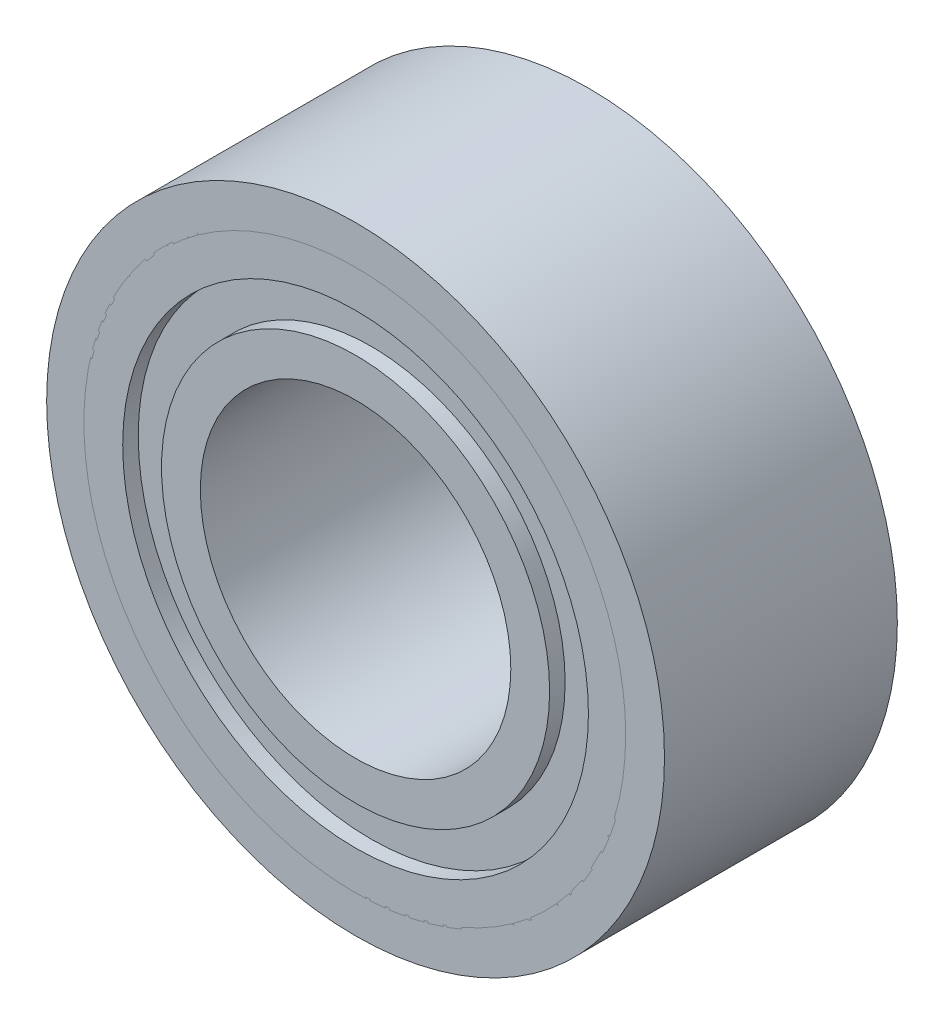
ISO-10303-21;
HEADER;
FILE_DESCRIPTION(('STEP AP214'),'2;1');
FILE_NAME('part.step','',(''),(''),'','','');
FILE_SCHEMA(('AUTOMOTIVE_DESIGN { 1 0 10303 214 1 1 1 1 }'));
ENDSEC;
DATA;
#1=APPLICATION_CONTEXT('core data for automotive mechanical design processes');
#2=APPLICATION_PROTOCOL_DEFINITION('international standard','automotive_design',2000,#1);
#3=PRODUCT_CONTEXT('',#1,'mechanical');
#4=PRODUCT('Part','Part','',(#3));
#5=PRODUCT_RELATED_PRODUCT_CATEGORY('part','',(#4));
#6=PRODUCT_DEFINITION_FORMATION('','',#4);
#7=PRODUCT_DEFINITION_CONTEXT('part definition',#1,'design');
#8=PRODUCT_DEFINITION('design','',#6,#7);
#9=PRODUCT_DEFINITION_SHAPE('','',#8);
#10=(LENGTH_UNIT() NAMED_UNIT(*) SI_UNIT(.MILLI.,.METRE.));
#11=(NAMED_UNIT(*) PLANE_ANGLE_UNIT() SI_UNIT($,.RADIAN.));
#12=(NAMED_UNIT(*) SI_UNIT($,.STERADIAN.) SOLID_ANGLE_UNIT());
#13=UNCERTAINTY_MEASURE_WITH_UNIT(LENGTH_MEASURE(1.E-05),#10,'distance_accuracy_value','');
#14=(GEOMETRIC_REPRESENTATION_CONTEXT(3) GLOBAL_UNCERTAINTY_ASSIGNED_CONTEXT((#13)) GLOBAL_UNIT_ASSIGNED_CONTEXT((#10,
#11,#12)) REPRESENTATION_CONTEXT('',''));
#15=CARTESIAN_POINT('',(0.,0.,0.));
#16=DIRECTION('',(0.,0.,1.));
#17=DIRECTION('',(1.,0.,0.));
#18=AXIS2_PLACEMENT_3D('',#15,#16,#17);
#19=CARTESIAN_POINT('',(0.,0.,0.2));
#20=DIRECTION('',(0.,0.,1.));
#21=DIRECTION('',(1.,0.,0.));
#22=AXIS2_PLACEMENT_3D('',#19,#20,#21);
#23=CYLINDRICAL_SURFACE('',#22,2.5);
#24=CARTESIAN_POINT('',(0.,0.,0.2));
#25=DIRECTION('',(0.,0.,1.));
#26=DIRECTION('',(1.,0.,0.));
#27=AXIS2_PLACEMENT_3D('',#24,#25,#26);
#28=CIRCLE('',#27,2.5);
#29=CARTESIAN_POINT('',(2.5,0.,0.2));
#30=VERTEX_POINT('',#29);
#31=EDGE_CURVE('E63',#30,#30,#28,.T.);
#32=ORIENTED_EDGE('',*,*,#31,.F.);
#33=EDGE_LOOP('',(#32));
#34=FACE_BOUND('',#33,.T.);
#35=CARTESIAN_POINT('',(0.,0.,2.8));
#36=DIRECTION('',(0.,0.,1.));
#37=DIRECTION('',(1.,0.,0.));
#38=AXIS2_PLACEMENT_3D('',#35,#36,#37);
#39=CIRCLE('',#38,2.5);
#40=CARTESIAN_POINT('',(2.5,0.,2.8));
#41=VERTEX_POINT('',#40);
#42=EDGE_CURVE('E51',#41,#41,#39,.F.);
#43=ORIENTED_EDGE('',*,*,#42,.F.);
#44=EDGE_LOOP('',(#43));
#45=FACE_BOUND('',#44,.T.);
#46=ADVANCED_FACE('F47',(#34,#45),#23,.F.);
#47=CARTESIAN_POINT('',(0.,0.,0.2));
#48=DIRECTION('',(0.,0.,1.));
#49=DIRECTION('',(1.,0.,0.));
#50=AXIS2_PLACEMENT_3D('',#47,#48,#49);
#51=CYLINDRICAL_SURFACE('',#50,3.5);
#52=CARTESIAN_POINT('',(0.,0.,0.2));
#53=DIRECTION('',(0.,0.,1.));
#54=DIRECTION('',(1.,0.,0.));
#55=AXIS2_PLACEMENT_3D('',#52,#53,#54);
#56=CIRCLE('',#55,3.5);
#57=CARTESIAN_POINT('',(3.5,0.,0.2));
#58=VERTEX_POINT('',#57);
#59=EDGE_CURVE('E11',#58,#58,#56,.T.);
#60=ORIENTED_EDGE('',*,*,#59,.T.);
#61=EDGE_LOOP('',(#60));
#62=FACE_BOUND('',#61,.T.);
#63=CARTESIAN_POINT('',(0.,0.,3.));
#64=DIRECTION('',(0.,0.,1.));
#65=DIRECTION('',(1.,0.,0.));
#66=AXIS2_PLACEMENT_3D('',#63,#64,#65);
#67=CIRCLE('',#66,3.5);
#68=CARTESIAN_POINT('',(3.5,0.,3.));
#69=VERTEX_POINT('',#68);
#70=EDGE_CURVE('E56',#69,#69,#67,.T.);
#71=ORIENTED_EDGE('',*,*,#70,.F.);
#72=EDGE_LOOP('',(#71));
#73=FACE_BOUND('',#72,.T.);
#74=ADVANCED_FACE('F49',(#62,#73),#51,.T.);
#75=CARTESIAN_POINT('',(0.,0.,0.2));
#76=DIRECTION('',(0.,0.,1.));
#77=DIRECTION('',(1.,0.,0.));
#78=AXIS2_PLACEMENT_3D('',#75,#76,#77);
#79=PLANE('',#78);
#80=ORIENTED_EDGE('',*,*,#31,.T.);
#81=EDGE_LOOP('',(#80));
#82=FACE_BOUND('',#81,.T.);
#83=ORIENTED_EDGE('',*,*,#59,.F.);
#84=EDGE_LOOP('',(#83));
#85=FACE_BOUND('',#84,.T.);
#86=ADVANCED_FACE('F91',(#82,#85),#79,.F.);
#87=CARTESIAN_POINT('',(0.,0.,3.));
#88=DIRECTION('',(0.,0.,1.));
#89=DIRECTION('',(1.,0.,0.));
#90=AXIS2_PLACEMENT_3D('',#87,#88,#89);
#91=PLANE('',#90);
#92=CARTESIAN_POINT('',(0.,0.,3.));
#93=DIRECTION('',(0.,0.,1.));
#94=DIRECTION('',(1.,0.,0.));
#95=AXIS2_PLACEMENT_3D('',#92,#93,#94);
#96=CIRCLE('',#95,3.);
#97=CARTESIAN_POINT('',(3.,0.,3.));
#98=VERTEX_POINT('',#97);
#99=EDGE_CURVE('E68',#98,#98,#96,.T.);
#100=ORIENTED_EDGE('',*,*,#99,.F.);
#101=EDGE_LOOP('',(#100));
#102=FACE_BOUND('',#101,.T.);
#103=ORIENTED_EDGE('',*,*,#70,.T.);
#104=EDGE_LOOP('',(#103));
#105=FACE_BOUND('',#104,.T.);
#106=ADVANCED_FACE('F98',(#102,#105),#91,.T.);
#107=CARTESIAN_POINT('',(0.,0.,2.8));
#108=DIRECTION('',(0.,0.,1.));
#109=DIRECTION('',(1.,0.,0.));
#110=AXIS2_PLACEMENT_3D('',#107,#108,#109);
#111=PLANE('',#110);
#112=CARTESIAN_POINT('',(0.,0.,2.8));
#113=DIRECTION('',(0.,0.,1.));
#114=DIRECTION('',(1.,0.,0.));
#115=AXIS2_PLACEMENT_3D('',#112,#113,#114);
#116=CIRCLE('',#115,3.);
#117=CARTESIAN_POINT('',(3.,0.,2.8));
#118=VERTEX_POINT('',#117);
#119=EDGE_CURVE('E72',#118,#118,#116,.T.);
#120=ORIENTED_EDGE('',*,*,#119,.T.);
#121=EDGE_LOOP('',(#120));
#122=FACE_BOUND('',#121,.T.);
#123=ORIENTED_EDGE('',*,*,#42,.T.);
#124=EDGE_LOOP('',(#123));
#125=FACE_BOUND('',#124,.T.);
#126=ADVANCED_FACE('F83',(#122,#125),#111,.T.);
#127=CARTESIAN_POINT('',(0.,0.,2.8));
#128=DIRECTION('',(0.,0.,1.));
#129=DIRECTION('',(1.,0.,0.));
#130=AXIS2_PLACEMENT_3D('',#127,#128,#129);
#131=CYLINDRICAL_SURFACE('',#130,3.);
#132=ORIENTED_EDGE('',*,*,#119,.F.);
#133=EDGE_LOOP('',(#132));
#134=FACE_BOUND('',#133,.T.);
#135=ORIENTED_EDGE('',*,*,#99,.T.);
#136=EDGE_LOOP('',(#135));
#137=FACE_BOUND('',#136,.T.);
#138=ADVANCED_FACE('F95',(#134,#137),#131,.F.);
#139=CLOSED_SHELL('',(#46,#74,#86,#106,#126,#138));
#140=MANIFOLD_SOLID_BREP('B2',#139);
#141=CARTESIAN_POINT('',(0.,0.,3.));
#142=DIRECTION('',(0.,0.,1.));
#143=DIRECTION('',(1.,0.,0.));
#144=AXIS2_PLACEMENT_3D('',#141,#142,#143);
#145=PLANE('',#144);
#146=CARTESIAN_POINT('',(0.,0.,3.));
#147=DIRECTION('',(0.,0.,1.));
#148=DIRECTION('',(1.,0.,0.));
#149=AXIS2_PLACEMENT_3D('',#146,#147,#148);
#150=CIRCLE('',#149,3.48);
#151=CARTESIAN_POINT('',(3.48,0.,3.));
#152=VERTEX_POINT('',#151);
#153=EDGE_CURVE('E46',#152,#152,#150,.T.);
#154=ORIENTED_EDGE('',*,*,#153,.F.);
#155=EDGE_LOOP('',(#154));
#156=FACE_BOUND('',#155,.T.);
#157=CARTESIAN_POINT('',(0.,0.,3.));
#158=DIRECTION('',(0.,0.,1.));
#159=DIRECTION('',(1.,0.,0.));
#160=AXIS2_PLACEMENT_3D('',#157,#158,#159);
#161=CIRCLE('',#160,3.98);
#162=CARTESIAN_POINT('',(3.98,0.,3.));
#163=VERTEX_POINT('',#162);
#164=EDGE_CURVE('E186',#163,#163,#161,.T.);
#165=ORIENTED_EDGE('',*,*,#164,.T.);
#166=EDGE_LOOP('',(#165));
#167=FACE_BOUND('',#166,.T.);
#168=ADVANCED_FACE('F169',(#156,#167),#145,.T.);
#169=CARTESIAN_POINT('',(0.,0.,0.));
#170=DIRECTION('',(0.,0.,1.));
#171=DIRECTION('',(1.,0.,0.));
#172=AXIS2_PLACEMENT_3D('',#169,#170,#171);
#173=PLANE('',#172);
#174=CARTESIAN_POINT('',(0.,0.,0.));
#175=DIRECTION('',(0.,0.,1.));
#176=DIRECTION('',(1.,0.,0.));
#177=AXIS2_PLACEMENT_3D('',#174,#175,#176);
#178=CIRCLE('',#177,3.48);
#179=CARTESIAN_POINT('',(3.48,0.,0.));
#180=VERTEX_POINT('',#179);
#181=EDGE_CURVE('E173',#180,#180,#178,.T.);
#182=ORIENTED_EDGE('',*,*,#181,.T.);
#183=EDGE_LOOP('',(#182));
#184=FACE_BOUND('',#183,.T.);
#185=CARTESIAN_POINT('',(0.,0.,0.));
#186=DIRECTION('',(0.,0.,1.));
#187=DIRECTION('',(1.,0.,0.));
#188=AXIS2_PLACEMENT_3D('',#185,#186,#187);
#189=CIRCLE('',#188,3.98);
#190=CARTESIAN_POINT('',(3.98,0.,0.));
#191=VERTEX_POINT('',#190);
#192=EDGE_CURVE('E178',#191,#191,#189,.T.);
#193=ORIENTED_EDGE('',*,*,#192,.F.);
#194=EDGE_LOOP('',(#193));
#195=FACE_BOUND('',#194,.T.);
#196=ADVANCED_FACE('F171',(#184,#195),#173,.F.);
#197=CARTESIAN_POINT('',(0.,0.,3.));
#198=DIRECTION('',(0.,0.,-1.));
#199=DIRECTION('',(-1.,0.,0.));
#200=AXIS2_PLACEMENT_3D('',#197,#198,#199);
#201=CYLINDRICAL_SURFACE('',#200,3.98);
#202=ORIENTED_EDGE('',*,*,#164,.F.);
#203=EDGE_LOOP('',(#202));
#204=FACE_BOUND('',#203,.T.);
#205=ORIENTED_EDGE('',*,*,#192,.T.);
#206=EDGE_LOOP('',(#205));
#207=FACE_BOUND('',#206,.T.);
#208=ADVANCED_FACE('F201',(#204,#207),#201,.T.);
#209=CARTESIAN_POINT('',(0.,0.,0.));
#210=DIRECTION('',(0.,0.,1.));
#211=DIRECTION('',(1.,0.,0.));
#212=AXIS2_PLACEMENT_3D('',#209,#210,#211);
#213=CYLINDRICAL_SURFACE('',#212,3.48);
#214=ORIENTED_EDGE('',*,*,#181,.F.);
#215=EDGE_LOOP('',(#214));
#216=FACE_BOUND('',#215,.T.);
#217=ORIENTED_EDGE('',*,*,#153,.T.);
#218=EDGE_LOOP('',(#217));
#219=FACE_BOUND('',#218,.T.);
#220=ADVANCED_FACE('F199',(#216,#219),#213,.F.);
#221=CLOSED_SHELL('',(#168,#196,#208,#220));
#222=MANIFOLD_SOLID_BREP('B6',#221);
#223=CARTESIAN_POINT('',(0.,0.,3.));
#224=DIRECTION('',(0.,0.,1.));
#225=DIRECTION('',(1.,0.,0.));
#226=AXIS2_PLACEMENT_3D('',#223,#224,#225);
#227=PLANE('',#226);
#228=CARTESIAN_POINT('',(0.,0.,3.));
#229=DIRECTION('',(0.,0.,1.));
#230=DIRECTION('',(1.,0.,0.));
#231=AXIS2_PLACEMENT_3D('',#228,#229,#230);
#232=CIRCLE('',#231,2.);
#233=CARTESIAN_POINT('',(2.,0.,3.));
#234=VERTEX_POINT('',#233);
#235=EDGE_CURVE('E168',#234,#234,#232,.T.);
#236=ORIENTED_EDGE('',*,*,#235,.F.);
#237=EDGE_LOOP('',(#236));
#238=FACE_BOUND('',#237,.T.);
#239=CARTESIAN_POINT('',(0.,0.,3.));
#240=DIRECTION('',(0.,0.,1.));
#241=DIRECTION('',(1.,0.,0.));
#242=AXIS2_PLACEMENT_3D('',#239,#240,#241);
#243=CIRCLE('',#242,2.5);
#244=CARTESIAN_POINT('',(2.5,0.,3.));
#245=VERTEX_POINT('',#244);
#246=EDGE_CURVE('E262',#245,#245,#243,.T.);
#247=ORIENTED_EDGE('',*,*,#246,.T.);
#248=EDGE_LOOP('',(#247));
#249=FACE_BOUND('',#248,.T.);
#250=ADVANCED_FACE('F246',(#238,#249),#227,.T.);
#251=CARTESIAN_POINT('',(0.,0.,3.));
#252=DIRECTION('',(0.,0.,-1.));
#253=DIRECTION('',(-1.,0.,0.));
#254=AXIS2_PLACEMENT_3D('',#251,#252,#253);
#255=CYLINDRICAL_SURFACE('',#254,2.);
#256=ORIENTED_EDGE('',*,*,#235,.T.);
#257=EDGE_LOOP('',(#256));
#258=FACE_BOUND('',#257,.T.);
#259=CARTESIAN_POINT('',(0.,0.,0.));
#260=DIRECTION('',(0.,0.,1.));
#261=DIRECTION('',(1.,0.,0.));
#262=AXIS2_PLACEMENT_3D('',#259,#260,#261);
#263=CIRCLE('',#262,2.);
#264=CARTESIAN_POINT('',(2.,0.,0.));
#265=VERTEX_POINT('',#264);
#266=EDGE_CURVE('E250',#265,#265,#263,.T.);
#267=ORIENTED_EDGE('',*,*,#266,.F.);
#268=EDGE_LOOP('',(#267));
#269=FACE_BOUND('',#268,.T.);
#270=ADVANCED_FACE('F275',(#258,#269),#255,.F.);
#271=CARTESIAN_POINT('',(0.,0.,0.));
#272=DIRECTION('',(0.,0.,1.));
#273=DIRECTION('',(1.,0.,0.));
#274=AXIS2_PLACEMENT_3D('',#271,#272,#273);
#275=PLANE('',#274);
#276=ORIENTED_EDGE('',*,*,#266,.T.);
#277=EDGE_LOOP('',(#276));
#278=FACE_BOUND('',#277,.T.);
#279=CARTESIAN_POINT('',(0.,0.,0.));
#280=DIRECTION('',(0.,0.,1.));
#281=DIRECTION('',(1.,0.,0.));
#282=AXIS2_PLACEMENT_3D('',#279,#280,#281);
#283=CIRCLE('',#282,2.5);
#284=CARTESIAN_POINT('',(2.5,0.,0.));
#285=VERTEX_POINT('',#284);
#286=EDGE_CURVE('E260',#285,#285,#283,.T.);
#287=ORIENTED_EDGE('',*,*,#286,.F.);
#288=EDGE_LOOP('',(#287));
#289=FACE_BOUND('',#288,.T.);
#290=ADVANCED_FACE('F248',(#278,#289),#275,.F.);
#291=CARTESIAN_POINT('',(0.,0.,0.));
#292=DIRECTION('',(0.,0.,1.));
#293=DIRECTION('',(1.,0.,0.));
#294=AXIS2_PLACEMENT_3D('',#291,#292,#293);
#295=CYLINDRICAL_SURFACE('',#294,2.5);
#296=ORIENTED_EDGE('',*,*,#286,.T.);
#297=EDGE_LOOP('',(#296));
#298=FACE_BOUND('',#297,.T.);
#299=ORIENTED_EDGE('',*,*,#246,.F.);
#300=EDGE_LOOP('',(#299));
#301=FACE_BOUND('',#300,.T.);
#302=ADVANCED_FACE('F271',(#298,#301),#295,.T.);
#303=CLOSED_SHELL('',(#250,#270,#290,#302));
#304=MANIFOLD_SOLID_BREP('B41',#303);
#305=ADVANCED_BREP_SHAPE_REPRESENTATION('',(#18,#140,#222,#304),#14);
#306=SHAPE_DEFINITION_REPRESENTATION(#9,#305);
ENDSEC;
END-ISO-10303-21;
